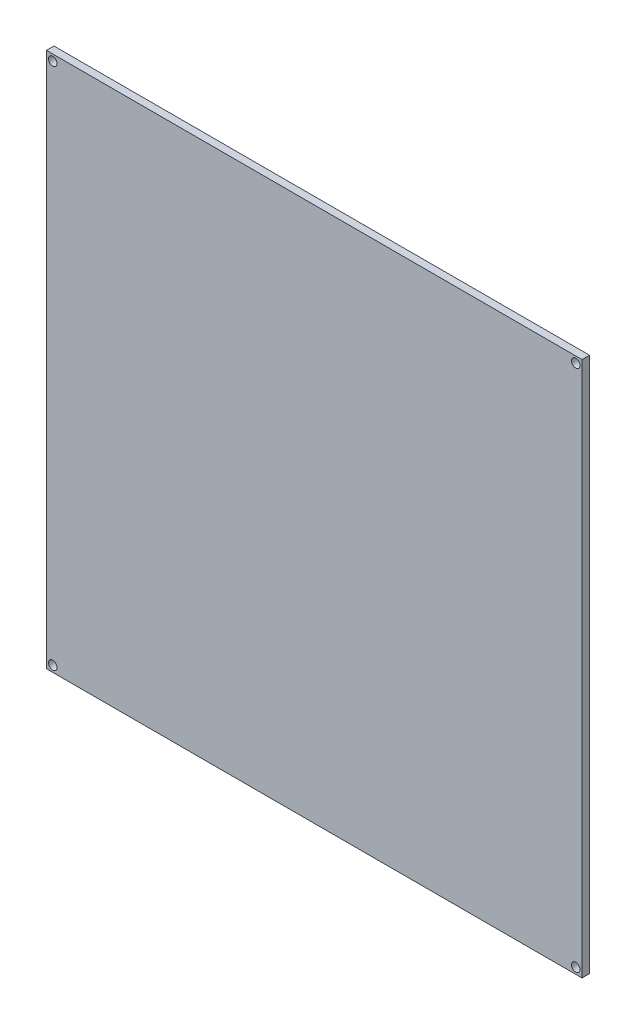
ISO-10303-21;
HEADER;
FILE_DESCRIPTION(('STEP AP214'),'2;1');
FILE_NAME('part.step','',(''),(''),'','','');
FILE_SCHEMA(('AUTOMOTIVE_DESIGN { 1 0 10303 214 1 1 1 1 }'));
ENDSEC;
DATA;
#1=APPLICATION_CONTEXT('core data for automotive mechanical design processes');
#2=APPLICATION_PROTOCOL_DEFINITION('international standard','automotive_design',2000,#1);
#3=PRODUCT_CONTEXT('',#1,'mechanical');
#4=PRODUCT('Part','Part','',(#3));
#5=PRODUCT_RELATED_PRODUCT_CATEGORY('part','',(#4));
#6=PRODUCT_DEFINITION_FORMATION('','',#4);
#7=PRODUCT_DEFINITION_CONTEXT('part definition',#1,'design');
#8=PRODUCT_DEFINITION('design','',#6,#7);
#9=PRODUCT_DEFINITION_SHAPE('','',#8);
#10=(LENGTH_UNIT() NAMED_UNIT(*) SI_UNIT(.MILLI.,.METRE.));
#11=(NAMED_UNIT(*) PLANE_ANGLE_UNIT() SI_UNIT($,.RADIAN.));
#12=(NAMED_UNIT(*) SI_UNIT($,.STERADIAN.) SOLID_ANGLE_UNIT());
#13=UNCERTAINTY_MEASURE_WITH_UNIT(LENGTH_MEASURE(1.E-05),#10,'distance_accuracy_value','');
#14=(GEOMETRIC_REPRESENTATION_CONTEXT(3) GLOBAL_UNCERTAINTY_ASSIGNED_CONTEXT((#13)) GLOBAL_UNIT_ASSIGNED_CONTEXT((#10,
#11,#12)) REPRESENTATION_CONTEXT('',''));
#15=CARTESIAN_POINT('',(0.,0.,0.));
#16=DIRECTION('',(0.,0.,1.));
#17=DIRECTION('',(1.,0.,0.));
#18=AXIS2_PLACEMENT_3D('',#15,#16,#17);
#19=CARTESIAN_POINT('',(0.,0.,-3.));
#20=DIRECTION('',(1.,0.,0.));
#21=DIRECTION('',(0.,0.,-1.));
#22=AXIS2_PLACEMENT_3D('',#19,#20,#21);
#23=PLANE('',#22);
#24=DIRECTION('',(0.,1.,0.));
#25=VECTOR('',#24,1.);
#26=CARTESIAN_POINT('',(0.,0.,0.));
#27=LINE('',#26,#25);
#28=CARTESIAN_POINT('',(0.,0.,0.));
#29=VERTEX_POINT('',#28);
#30=CARTESIAN_POINT('',(0.,214.,0.));
#31=VERTEX_POINT('',#30);
#32=EDGE_CURVE('E99',#29,#31,#27,.T.);
#33=ORIENTED_EDGE('',*,*,#32,.F.);
#34=DIRECTION('',(0.,0.,1.));
#35=VECTOR('',#34,1.);
#36=CARTESIAN_POINT('',(0.,0.,-3.));
#37=LINE('',#36,#35);
#38=CARTESIAN_POINT('',(0.,0.,-3.));
#39=VERTEX_POINT('',#38);
#40=EDGE_CURVE('E11',#39,#29,#37,.T.);
#41=ORIENTED_EDGE('',*,*,#40,.F.);
#42=DIRECTION('',(0.,1.,0.));
#43=VECTOR('',#42,1.);
#44=CARTESIAN_POINT('',(0.,0.,-3.));
#45=LINE('',#44,#43);
#46=CARTESIAN_POINT('',(0.,214.,-3.));
#47=VERTEX_POINT('',#46);
#48=EDGE_CURVE('E92',#39,#47,#45,.T.);
#49=ORIENTED_EDGE('',*,*,#48,.T.);
#50=DIRECTION('',(0.,0.,1.));
#51=VECTOR('',#50,1.);
#52=CARTESIAN_POINT('',(0.,214.,-3.));
#53=LINE('',#52,#51);
#54=EDGE_CURVE('E37',#47,#31,#53,.T.);
#55=ORIENTED_EDGE('',*,*,#54,.T.);
#56=EDGE_LOOP('',(#33,#41,#49,#55));
#57=FACE_BOUND('',#56,.T.);
#58=ADVANCED_FACE('F34',(#57),#23,.T.);
#59=CARTESIAN_POINT('',(0.,0.,-3.));
#60=DIRECTION('',(0.,-1.,0.));
#61=DIRECTION('',(1.,0.,0.));
#62=AXIS2_PLACEMENT_3D('',#59,#60,#61);
#63=PLANE('',#62);
#64=DIRECTION('',(1.,0.,0.));
#65=VECTOR('',#64,1.);
#66=CARTESIAN_POINT('',(0.,0.,0.));
#67=LINE('',#66,#65);
#68=CARTESIAN_POINT('',(-214.,0.,0.));
#69=VERTEX_POINT('',#68);
#70=EDGE_CURVE('E94',#69,#29,#67,.T.);
#71=ORIENTED_EDGE('',*,*,#70,.F.);
#72=DIRECTION('',(0.,0.,1.));
#73=VECTOR('',#72,1.);
#74=CARTESIAN_POINT('',(-214.,0.,-3.));
#75=LINE('',#74,#73);
#76=CARTESIAN_POINT('',(-214.,0.,-3.));
#77=VERTEX_POINT('',#76);
#78=EDGE_CURVE('E43',#77,#69,#75,.T.);
#79=ORIENTED_EDGE('',*,*,#78,.F.);
#80=DIRECTION('',(1.,0.,0.));
#81=VECTOR('',#80,1.);
#82=CARTESIAN_POINT('',(0.,0.,-3.));
#83=LINE('',#82,#81);
#84=EDGE_CURVE('E89',#77,#39,#83,.T.);
#85=ORIENTED_EDGE('',*,*,#84,.T.);
#86=ORIENTED_EDGE('',*,*,#40,.T.);
#87=EDGE_LOOP('',(#71,#79,#85,#86));
#88=FACE_BOUND('',#87,.T.);
#89=ADVANCED_FACE('F110',(#88),#63,.T.);
#90=CARTESIAN_POINT('',(-214.,0.,-3.));
#91=DIRECTION('',(-1.,0.,0.));
#92=DIRECTION('',(0.,0.,1.));
#93=AXIS2_PLACEMENT_3D('',#90,#91,#92);
#94=PLANE('',#93);
#95=DIRECTION('',(0.,-1.,0.));
#96=VECTOR('',#95,1.);
#97=CARTESIAN_POINT('',(-214.,0.,0.));
#98=LINE('',#97,#96);
#99=CARTESIAN_POINT('',(-214.,214.,0.));
#100=VERTEX_POINT('',#99);
#101=EDGE_CURVE('E84',#100,#69,#98,.T.);
#102=ORIENTED_EDGE('',*,*,#101,.F.);
#103=DIRECTION('',(0.,0.,1.));
#104=VECTOR('',#103,1.);
#105=CARTESIAN_POINT('',(-214.,214.,-3.));
#106=LINE('',#105,#104);
#107=CARTESIAN_POINT('',(-214.,214.,-3.));
#108=VERTEX_POINT('',#107);
#109=EDGE_CURVE('E79',#108,#100,#106,.T.);
#110=ORIENTED_EDGE('',*,*,#109,.F.);
#111=DIRECTION('',(0.,-1.,0.));
#112=VECTOR('',#111,1.);
#113=CARTESIAN_POINT('',(-214.,0.,-3.));
#114=LINE('',#113,#112);
#115=EDGE_CURVE('E82',#108,#77,#114,.T.);
#116=ORIENTED_EDGE('',*,*,#115,.T.);
#117=ORIENTED_EDGE('',*,*,#78,.T.);
#118=EDGE_LOOP('',(#102,#110,#116,#117));
#119=FACE_BOUND('',#118,.T.);
#120=ADVANCED_FACE('F81',(#119),#94,.T.);
#121=CARTESIAN_POINT('',(0.,214.,-3.));
#122=DIRECTION('',(0.,1.,0.));
#123=DIRECTION('',(-1.,0.,0.));
#124=AXIS2_PLACEMENT_3D('',#121,#122,#123);
#125=PLANE('',#124);
#126=DIRECTION('',(-1.,0.,0.));
#127=VECTOR('',#126,1.);
#128=CARTESIAN_POINT('',(0.,214.,0.));
#129=LINE('',#128,#127);
#130=EDGE_CURVE('E102',#31,#100,#129,.T.);
#131=ORIENTED_EDGE('',*,*,#130,.F.);
#132=ORIENTED_EDGE('',*,*,#54,.F.);
#133=DIRECTION('',(-1.,0.,0.));
#134=VECTOR('',#133,1.);
#135=CARTESIAN_POINT('',(0.,214.,-3.));
#136=LINE('',#135,#134);
#137=EDGE_CURVE('E88',#47,#108,#136,.T.);
#138=ORIENTED_EDGE('',*,*,#137,.T.);
#139=ORIENTED_EDGE('',*,*,#109,.T.);
#140=EDGE_LOOP('',(#131,#132,#138,#139));
#141=FACE_BOUND('',#140,.T.);
#142=ADVANCED_FACE('F91',(#141),#125,.T.);
#143=CARTESIAN_POINT('',(0.,0.,-3.));
#144=DIRECTION('',(0.,0.,1.));
#145=DIRECTION('',(1.,0.,0.));
#146=AXIS2_PLACEMENT_3D('',#143,#144,#145);
#147=PLANE('',#146);
#148=CARTESIAN_POINT('',(-2.49999999999997,211.5,-3.));
#149=DIRECTION('',(0.,0.,1.));
#150=DIRECTION('',(1.,0.,0.));
#151=AXIS2_PLACEMENT_3D('',#148,#149,#150);
#152=CIRCLE('',#151,1.69999999999999);
#153=CARTESIAN_POINT('',(-0.799999999999981,211.5,-3.));
#154=VERTEX_POINT('',#153);
#155=EDGE_CURVE('E151',#154,#154,#152,.T.);
#156=ORIENTED_EDGE('',*,*,#155,.T.);
#157=EDGE_LOOP('',(#156));
#158=FACE_BOUND('',#157,.T.);
#159=CARTESIAN_POINT('',(-2.49999999999997,2.49999999999991,-3.));
#160=DIRECTION('',(0.,0.,1.));
#161=DIRECTION('',(1.,0.,0.));
#162=AXIS2_PLACEMENT_3D('',#159,#160,#161);
#163=CIRCLE('',#162,1.69999999999999);
#164=CARTESIAN_POINT('',(-0.799999999999981,2.49999999999991,-3.));
#165=VERTEX_POINT('',#164);
#166=EDGE_CURVE('E161',#165,#165,#163,.T.);
#167=ORIENTED_EDGE('',*,*,#166,.T.);
#168=EDGE_LOOP('',(#167));
#169=FACE_BOUND('',#168,.T.);
#170=CARTESIAN_POINT('',(-211.5,211.5,-3.));
#171=DIRECTION('',(0.,0.,1.));
#172=DIRECTION('',(1.,0.,0.));
#173=AXIS2_PLACEMENT_3D('',#170,#171,#172);
#174=CIRCLE('',#173,1.69999999999999);
#175=CARTESIAN_POINT('',(-209.8,211.5,-3.));
#176=VERTEX_POINT('',#175);
#177=EDGE_CURVE('E167',#176,#176,#174,.T.);
#178=ORIENTED_EDGE('',*,*,#177,.T.);
#179=EDGE_LOOP('',(#178));
#180=FACE_BOUND('',#179,.T.);
#181=CARTESIAN_POINT('',(-211.5,2.49999999999991,-3.));
#182=DIRECTION('',(0.,0.,1.));
#183=DIRECTION('',(1.,0.,0.));
#184=AXIS2_PLACEMENT_3D('',#181,#182,#183);
#185=CIRCLE('',#184,1.69999999999999);
#186=CARTESIAN_POINT('',(-209.8,2.49999999999991,-3.));
#187=VERTEX_POINT('',#186);
#188=EDGE_CURVE('E103',#187,#187,#185,.T.);
#189=ORIENTED_EDGE('',*,*,#188,.T.);
#190=EDGE_LOOP('',(#189));
#191=FACE_BOUND('',#190,.T.);
#192=ORIENTED_EDGE('',*,*,#48,.F.);
#193=ORIENTED_EDGE('',*,*,#84,.F.);
#194=ORIENTED_EDGE('',*,*,#115,.F.);
#195=ORIENTED_EDGE('',*,*,#137,.F.);
#196=EDGE_LOOP('',(#192,#193,#194,#195));
#197=FACE_BOUND('',#196,.T.);
#198=ADVANCED_FACE('F87',(#158,#169,#180,#191,#197),#147,.F.);
#199=CARTESIAN_POINT('',(0.,0.,0.));
#200=DIRECTION('',(0.,0.,1.));
#201=DIRECTION('',(1.,0.,0.));
#202=AXIS2_PLACEMENT_3D('',#199,#200,#201);
#203=PLANE('',#202);
#204=CARTESIAN_POINT('',(-2.49999999999997,211.5,0.));
#205=DIRECTION('',(0.,0.,1.));
#206=DIRECTION('',(1.,0.,0.));
#207=AXIS2_PLACEMENT_3D('',#204,#205,#206);
#208=CIRCLE('',#207,1.69999999999999);
#209=CARTESIAN_POINT('',(-0.799999999999986,211.5,0.));
#210=VERTEX_POINT('',#209);
#211=EDGE_CURVE('E154',#210,#210,#208,.T.);
#212=ORIENTED_EDGE('',*,*,#211,.F.);
#213=EDGE_LOOP('',(#212));
#214=FACE_BOUND('',#213,.T.);
#215=CARTESIAN_POINT('',(-2.49999999999997,2.49999999999991,0.));
#216=DIRECTION('',(0.,0.,1.));
#217=DIRECTION('',(1.,0.,0.));
#218=AXIS2_PLACEMENT_3D('',#215,#216,#217);
#219=CIRCLE('',#218,1.69999999999999);
#220=CARTESIAN_POINT('',(-0.799999999999986,2.49999999999991,0.));
#221=VERTEX_POINT('',#220);
#222=EDGE_CURVE('E156',#221,#221,#219,.T.);
#223=ORIENTED_EDGE('',*,*,#222,.F.);
#224=EDGE_LOOP('',(#223));
#225=FACE_BOUND('',#224,.T.);
#226=CARTESIAN_POINT('',(-211.5,211.5,0.));
#227=DIRECTION('',(0.,0.,1.));
#228=DIRECTION('',(1.,0.,0.));
#229=AXIS2_PLACEMENT_3D('',#226,#227,#228);
#230=CIRCLE('',#229,1.69999999999998);
#231=CARTESIAN_POINT('',(-209.8,211.5,0.));
#232=VERTEX_POINT('',#231);
#233=EDGE_CURVE('E164',#232,#232,#230,.T.);
#234=ORIENTED_EDGE('',*,*,#233,.F.);
#235=EDGE_LOOP('',(#234));
#236=FACE_BOUND('',#235,.T.);
#237=CARTESIAN_POINT('',(-211.5,2.49999999999991,0.));
#238=DIRECTION('',(0.,0.,1.));
#239=DIRECTION('',(1.,0.,0.));
#240=AXIS2_PLACEMENT_3D('',#237,#238,#239);
#241=CIRCLE('',#240,1.69999999999998);
#242=CARTESIAN_POINT('',(-209.8,2.49999999999991,0.));
#243=VERTEX_POINT('',#242);
#244=EDGE_CURVE('E170',#243,#243,#241,.T.);
#245=ORIENTED_EDGE('',*,*,#244,.F.);
#246=EDGE_LOOP('',(#245));
#247=FACE_BOUND('',#246,.T.);
#248=ORIENTED_EDGE('',*,*,#32,.T.);
#249=ORIENTED_EDGE('',*,*,#130,.T.);
#250=ORIENTED_EDGE('',*,*,#101,.T.);
#251=ORIENTED_EDGE('',*,*,#70,.T.);
#252=EDGE_LOOP('',(#248,#249,#250,#251));
#253=FACE_BOUND('',#252,.T.);
#254=ADVANCED_FACE('F109',(#214,#225,#236,#247,#253),#203,.T.);
#255=CARTESIAN_POINT('',(-211.5,2.49999999999991,0.));
#256=DIRECTION('',(0.,0.,1.));
#257=DIRECTION('',(1.,0.,0.));
#258=AXIS2_PLACEMENT_3D('',#255,#256,#257);
#259=CYLINDRICAL_SURFACE('',#258,1.69999999999999);
#260=ORIENTED_EDGE('',*,*,#188,.F.);
#261=EDGE_LOOP('',(#260));
#262=FACE_BOUND('',#261,.T.);
#263=ORIENTED_EDGE('',*,*,#244,.T.);
#264=EDGE_LOOP('',(#263));
#265=FACE_BOUND('',#264,.T.);
#266=ADVANCED_FACE('F128',(#262,#265),#259,.F.);
#267=CARTESIAN_POINT('',(-211.5,211.5,0.));
#268=DIRECTION('',(0.,0.,1.));
#269=DIRECTION('',(1.,0.,0.));
#270=AXIS2_PLACEMENT_3D('',#267,#268,#269);
#271=CYLINDRICAL_SURFACE('',#270,1.69999999999999);
#272=ORIENTED_EDGE('',*,*,#177,.F.);
#273=EDGE_LOOP('',(#272));
#274=FACE_BOUND('',#273,.T.);
#275=ORIENTED_EDGE('',*,*,#233,.T.);
#276=EDGE_LOOP('',(#275));
#277=FACE_BOUND('',#276,.T.);
#278=ADVANCED_FACE('F135',(#274,#277),#271,.F.);
#279=CARTESIAN_POINT('',(-2.49999999999997,2.49999999999991,0.));
#280=DIRECTION('',(0.,0.,1.));
#281=DIRECTION('',(1.,0.,0.));
#282=AXIS2_PLACEMENT_3D('',#279,#280,#281);
#283=CYLINDRICAL_SURFACE('',#282,1.69999999999999);
#284=ORIENTED_EDGE('',*,*,#166,.F.);
#285=EDGE_LOOP('',(#284));
#286=FACE_BOUND('',#285,.T.);
#287=ORIENTED_EDGE('',*,*,#222,.T.);
#288=EDGE_LOOP('',(#287));
#289=FACE_BOUND('',#288,.T.);
#290=ADVANCED_FACE('F139',(#286,#289),#283,.F.);
#291=CARTESIAN_POINT('',(-2.49999999999997,211.5,0.));
#292=DIRECTION('',(0.,0.,1.));
#293=DIRECTION('',(1.,0.,0.));
#294=AXIS2_PLACEMENT_3D('',#291,#292,#293);
#295=CYLINDRICAL_SURFACE('',#294,1.69999999999999);
#296=ORIENTED_EDGE('',*,*,#155,.F.);
#297=EDGE_LOOP('',(#296));
#298=FACE_BOUND('',#297,.T.);
#299=ORIENTED_EDGE('',*,*,#211,.T.);
#300=EDGE_LOOP('',(#299));
#301=FACE_BOUND('',#300,.T.);
#302=ADVANCED_FACE('F143',(#298,#301),#295,.F.);
#303=CLOSED_SHELL('',(#58,#89,#120,#142,#198,#254,#266,#278,#290,#302));
#304=MANIFOLD_SOLID_BREP('B2',#303);
#305=ADVANCED_BREP_SHAPE_REPRESENTATION('',(#18,#304),#14);
#306=SHAPE_DEFINITION_REPRESENTATION(#9,#305);
ENDSEC;
END-ISO-10303-21;
